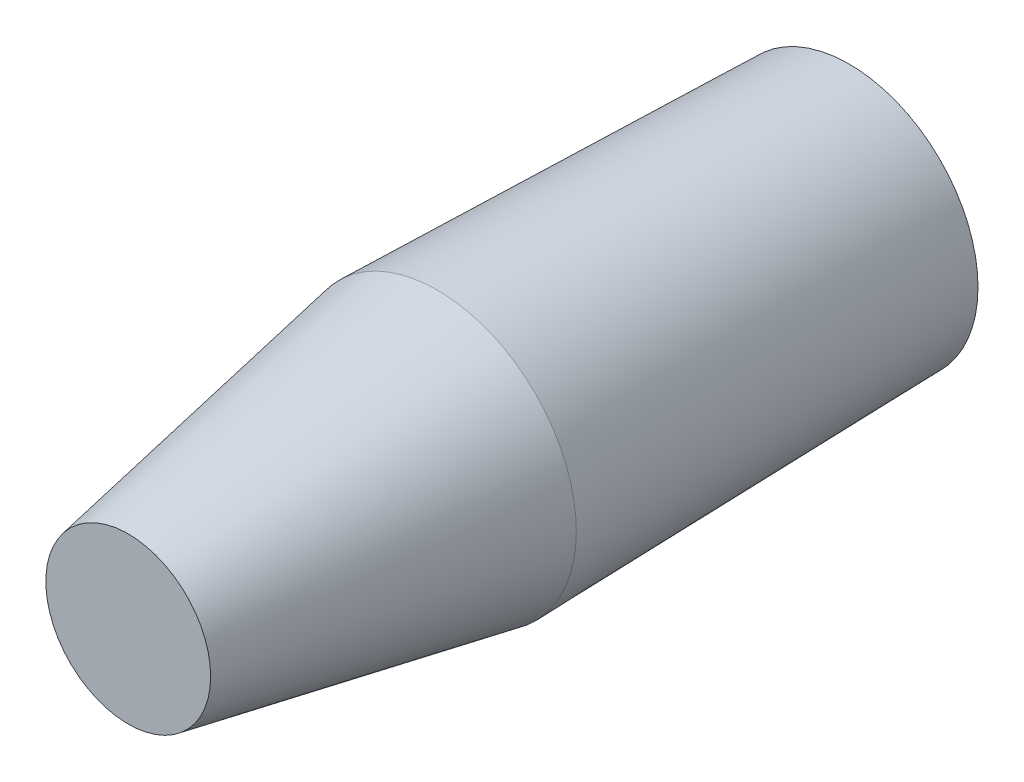
ISO-10303-21;
HEADER;
FILE_DESCRIPTION(('STEP AP214'),'2;1');
FILE_NAME('part.step','',(''),(''),'','','');
FILE_SCHEMA(('AUTOMOTIVE_DESIGN { 1 0 10303 214 1 1 1 1 }'));
ENDSEC;
DATA;
#1=APPLICATION_CONTEXT('core data for automotive mechanical design processes');
#2=APPLICATION_PROTOCOL_DEFINITION('international standard','automotive_design',2000,#1);
#3=PRODUCT_CONTEXT('',#1,'mechanical');
#4=PRODUCT('Part','Part','',(#3));
#5=PRODUCT_RELATED_PRODUCT_CATEGORY('part','',(#4));
#6=PRODUCT_DEFINITION_FORMATION('','',#4);
#7=PRODUCT_DEFINITION_CONTEXT('part definition',#1,'design');
#8=PRODUCT_DEFINITION('design','',#6,#7);
#9=PRODUCT_DEFINITION_SHAPE('','',#8);
#10=(LENGTH_UNIT() NAMED_UNIT(*) SI_UNIT(.MILLI.,.METRE.));
#11=(NAMED_UNIT(*) PLANE_ANGLE_UNIT() SI_UNIT($,.RADIAN.));
#12=(NAMED_UNIT(*) SI_UNIT($,.STERADIAN.) SOLID_ANGLE_UNIT());
#13=UNCERTAINTY_MEASURE_WITH_UNIT(LENGTH_MEASURE(1.E-05),#10,'distance_accuracy_value','');
#14=(GEOMETRIC_REPRESENTATION_CONTEXT(3) GLOBAL_UNCERTAINTY_ASSIGNED_CONTEXT((#13)) GLOBAL_UNIT_ASSIGNED_CONTEXT((#10,
#11,#12)) REPRESENTATION_CONTEXT('',''));
#15=CARTESIAN_POINT('',(0.,0.,0.));
#16=DIRECTION('',(0.,0.,1.));
#17=DIRECTION('',(1.,0.,0.));
#18=AXIS2_PLACEMENT_3D('',#15,#16,#17);
#19=CARTESIAN_POINT('',(0.,0.,0.));
#20=DIRECTION('',(0.,0.,1.));
#21=DIRECTION('',(1.,0.,0.));
#22=AXIS2_PLACEMENT_3D('',#19,#20,#21);
#23=PLANE('',#22);
#24=CARTESIAN_POINT('',(0.,0.,0.));
#25=DIRECTION('',(0.,0.,1.));
#26=DIRECTION('',(1.,0.,0.));
#27=AXIS2_PLACEMENT_3D('',#24,#25,#26);
#28=CIRCLE('',#27,25.);
#29=CARTESIAN_POINT('',(25.,0.,0.));
#30=VERTEX_POINT('',#29);
#31=EDGE_CURVE('E52',#30,#30,#28,.T.);
#32=ORIENTED_EDGE('',*,*,#31,.F.);
#33=EDGE_LOOP('',(#32));
#34=FACE_BOUND('',#33,.T.);
#35=ADVANCED_FACE('F43',(#34),#23,.F.);
#36=CARTESIAN_POINT('',(0.,0.,0.));
#37=DIRECTION('',(0.,0.,1.));
#38=DIRECTION('',(1.,0.,0.));
#39=AXIS2_PLACEMENT_3D('',#36,#37,#38);
#40=CONICAL_SURFACE('',#39,25.,0.0249947936189201);
#41=ORIENTED_EDGE('',*,*,#31,.T.);
#42=EDGE_LOOP('',(#41));
#43=FACE_BOUND('',#42,.T.);
#44=CARTESIAN_POINT('',(0.,0.,80.));
#45=DIRECTION('',(0.,0.,1.));
#46=DIRECTION('',(1.,0.,0.));
#47=AXIS2_PLACEMENT_3D('',#44,#45,#46);
#48=CIRCLE('',#47,27.);
#49=CARTESIAN_POINT('',(27.,0.,80.));
#50=VERTEX_POINT('',#49);
#51=EDGE_CURVE('E11',#50,#50,#48,.T.);
#52=ORIENTED_EDGE('',*,*,#51,.F.);
#53=EDGE_LOOP('',(#52));
#54=FACE_BOUND('',#53,.T.);
#55=ADVANCED_FACE('F45',(#43,#54),#40,.T.);
#56=CARTESIAN_POINT('',(0.,0.,140.));
#57=DIRECTION('',(0.,0.,1.));
#58=DIRECTION('',(1.,0.,0.));
#59=AXIS2_PLACEMENT_3D('',#56,#57,#58);
#60=PLANE('',#59);
#61=CARTESIAN_POINT('',(0.,0.,140.));
#62=DIRECTION('',(0.,0.,1.));
#63=DIRECTION('',(1.,0.,0.));
#64=AXIS2_PLACEMENT_3D('',#61,#62,#63);
#65=CIRCLE('',#64,16.);
#66=CARTESIAN_POINT('',(16.,0.,140.));
#67=VERTEX_POINT('',#66);
#68=EDGE_CURVE('E57',#67,#67,#65,.T.);
#69=ORIENTED_EDGE('',*,*,#68,.T.);
#70=EDGE_LOOP('',(#69));
#71=FACE_BOUND('',#70,.T.);
#72=ADVANCED_FACE('F84',(#71),#60,.T.);
#73=CARTESIAN_POINT('',(0.,0.,140.));
#74=DIRECTION('',(0.,0.,-1.));
#75=DIRECTION('',(-1.,0.,0.));
#76=AXIS2_PLACEMENT_3D('',#73,#74,#75);
#77=CONICAL_SURFACE('',#76,16.,0.18131977440149);
#78=ORIENTED_EDGE('',*,*,#51,.T.);
#79=EDGE_LOOP('',(#78));
#80=FACE_BOUND('',#79,.T.);
#81=ORIENTED_EDGE('',*,*,#68,.F.);
#82=EDGE_LOOP('',(#81));
#83=FACE_BOUND('',#82,.T.);
#84=ADVANCED_FACE('F80',(#80,#83),#77,.T.);
#85=CLOSED_SHELL('',(#35,#55,#72,#84));
#86=MANIFOLD_SOLID_BREP('B2',#85);
#87=ADVANCED_BREP_SHAPE_REPRESENTATION('',(#18,#86),#14);
#88=SHAPE_DEFINITION_REPRESENTATION(#9,#87);
ENDSEC;
END-ISO-10303-21;
